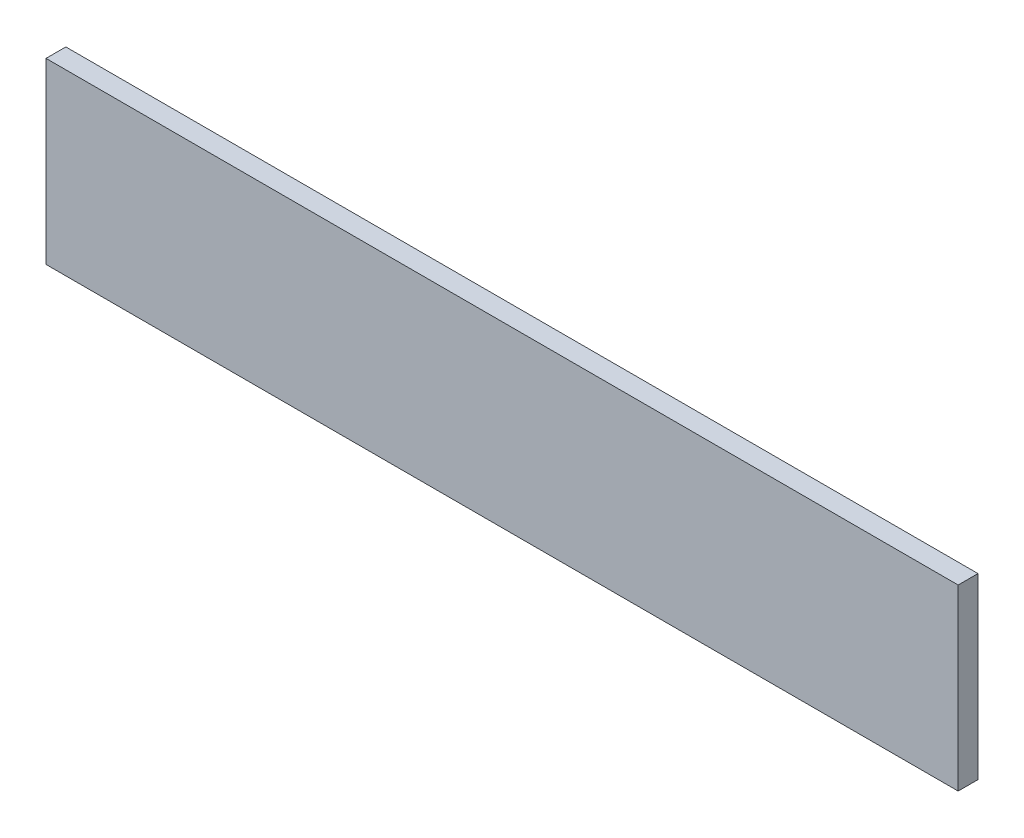
ISO-10303-21;
HEADER;
FILE_DESCRIPTION(('STEP AP214'),'2;1');
FILE_NAME('part.step','',(''),(''),'','','');
FILE_SCHEMA(('AUTOMOTIVE_DESIGN { 1 0 10303 214 1 1 1 1 }'));
ENDSEC;
DATA;
#1=APPLICATION_CONTEXT('core data for automotive mechanical design processes');
#2=APPLICATION_PROTOCOL_DEFINITION('international standard','automotive_design',2000,#1);
#3=PRODUCT_CONTEXT('',#1,'mechanical');
#4=PRODUCT('Part','Part','',(#3));
#5=PRODUCT_RELATED_PRODUCT_CATEGORY('part','',(#4));
#6=PRODUCT_DEFINITION_FORMATION('','',#4);
#7=PRODUCT_DEFINITION_CONTEXT('part definition',#1,'design');
#8=PRODUCT_DEFINITION('design','',#6,#7);
#9=PRODUCT_DEFINITION_SHAPE('','',#8);
#10=(LENGTH_UNIT() NAMED_UNIT(*) SI_UNIT(.MILLI.,.METRE.));
#11=(NAMED_UNIT(*) PLANE_ANGLE_UNIT() SI_UNIT($,.RADIAN.));
#12=(NAMED_UNIT(*) SI_UNIT($,.STERADIAN.) SOLID_ANGLE_UNIT());
#13=UNCERTAINTY_MEASURE_WITH_UNIT(LENGTH_MEASURE(1.E-05),#10,'distance_accuracy_value','');
#14=(GEOMETRIC_REPRESENTATION_CONTEXT(3) GLOBAL_UNCERTAINTY_ASSIGNED_CONTEXT((#13)) GLOBAL_UNIT_ASSIGNED_CONTEXT((#10,
#11,#12)) REPRESENTATION_CONTEXT('',''));
#15=CARTESIAN_POINT('',(0.,0.,0.));
#16=DIRECTION('',(0.,0.,1.));
#17=DIRECTION('',(1.,0.,0.));
#18=AXIS2_PLACEMENT_3D('',#15,#16,#17);
#19=CARTESIAN_POINT('',(0.,0.,6.35));
#20=DIRECTION('',(-1.,0.,0.));
#21=DIRECTION('',(0.,0.,1.));
#22=AXIS2_PLACEMENT_3D('',#19,#20,#21);
#23=PLANE('',#22);
#24=DIRECTION('',(0.,1.,0.));
#25=VECTOR('',#24,1.);
#26=CARTESIAN_POINT('',(0.,0.,0.));
#27=LINE('',#26,#25);
#28=CARTESIAN_POINT('',(0.,0.,0.));
#29=VERTEX_POINT('',#28);
#30=CARTESIAN_POINT('',(0.,57.15,0.));
#31=VERTEX_POINT('',#30);
#32=EDGE_CURVE('E110',#29,#31,#27,.T.);
#33=ORIENTED_EDGE('',*,*,#32,.F.);
#34=DIRECTION('',(0.,0.,-1.));
#35=VECTOR('',#34,1.);
#36=CARTESIAN_POINT('',(0.,0.,6.35));
#37=LINE('',#36,#35);
#38=CARTESIAN_POINT('',(0.,0.,6.35));
#39=VERTEX_POINT('',#38);
#40=EDGE_CURVE('E11',#39,#29,#37,.T.);
#41=ORIENTED_EDGE('',*,*,#40,.F.);
#42=DIRECTION('',(0.,1.,0.));
#43=VECTOR('',#42,1.);
#44=CARTESIAN_POINT('',(0.,0.,6.35));
#45=LINE('',#44,#43);
#46=CARTESIAN_POINT('',(0.,57.15,6.35));
#47=VERTEX_POINT('',#46);
#48=EDGE_CURVE('E103',#39,#47,#45,.T.);
#49=ORIENTED_EDGE('',*,*,#48,.T.);
#50=DIRECTION('',(0.,0.,-1.));
#51=VECTOR('',#50,1.);
#52=CARTESIAN_POINT('',(0.,57.15,6.35));
#53=LINE('',#52,#51);
#54=EDGE_CURVE('E42',#47,#31,#53,.T.);
#55=ORIENTED_EDGE('',*,*,#54,.T.);
#56=EDGE_LOOP('',(#33,#41,#49,#55));
#57=FACE_BOUND('',#56,.T.);
#58=ADVANCED_FACE('F39',(#57),#23,.T.);
#59=CARTESIAN_POINT('',(0.,0.,6.35));
#60=DIRECTION('',(0.,1.,0.));
#61=DIRECTION('',(0.,0.,1.));
#62=AXIS2_PLACEMENT_3D('',#59,#60,#61);
#63=PLANE('',#62);
#64=DIRECTION('',(1.,0.,0.));
#65=VECTOR('',#64,1.);
#66=CARTESIAN_POINT('',(0.,0.,0.));
#67=LINE('',#66,#65);
#68=CARTESIAN_POINT('',(292.1,0.,0.));
#69=VERTEX_POINT('',#68);
#70=EDGE_CURVE('E73',#29,#69,#67,.T.);
#71=ORIENTED_EDGE('',*,*,#70,.T.);
#72=DIRECTION('',(0.,0.,-1.));
#73=VECTOR('',#72,1.);
#74=CARTESIAN_POINT('',(292.1,0.,6.35));
#75=LINE('',#74,#73);
#76=CARTESIAN_POINT('',(292.1,0.,6.35));
#77=VERTEX_POINT('',#76);
#78=EDGE_CURVE('E49',#77,#69,#75,.T.);
#79=ORIENTED_EDGE('',*,*,#78,.F.);
#80=DIRECTION('',(1.,0.,0.));
#81=VECTOR('',#80,1.);
#82=CARTESIAN_POINT('',(0.,0.,6.35));
#83=LINE('',#82,#81);
#84=EDGE_CURVE('E90',#39,#77,#83,.T.);
#85=ORIENTED_EDGE('',*,*,#84,.F.);
#86=ORIENTED_EDGE('',*,*,#40,.T.);
#87=EDGE_LOOP('',(#71,#79,#85,#86));
#88=FACE_BOUND('',#87,.T.);
#89=ADVANCED_FACE('F126',(#88),#63,.F.);
#90=CARTESIAN_POINT('',(292.1,0.,6.35));
#91=DIRECTION('',(-1.,0.,0.));
#92=DIRECTION('',(0.,0.,1.));
#93=AXIS2_PLACEMENT_3D('',#90,#91,#92);
#94=PLANE('',#93);
#95=DIRECTION('',(0.,1.,0.));
#96=VECTOR('',#95,1.);
#97=CARTESIAN_POINT('',(292.1,0.,0.));
#98=LINE('',#97,#96);
#99=CARTESIAN_POINT('',(292.1,57.15,0.));
#100=VERTEX_POINT('',#99);
#101=EDGE_CURVE('E98',#69,#100,#98,.T.);
#102=ORIENTED_EDGE('',*,*,#101,.T.);
#103=DIRECTION('',(0.,0.,-1.));
#104=VECTOR('',#103,1.);
#105=CARTESIAN_POINT('',(292.1,57.15,6.35));
#106=LINE('',#105,#104);
#107=CARTESIAN_POINT('',(292.1,57.15,6.35));
#108=VERTEX_POINT('',#107);
#109=EDGE_CURVE('E95',#108,#100,#106,.T.);
#110=ORIENTED_EDGE('',*,*,#109,.F.);
#111=DIRECTION('',(0.,1.,0.));
#112=VECTOR('',#111,1.);
#113=CARTESIAN_POINT('',(292.1,0.,6.35));
#114=LINE('',#113,#112);
#115=EDGE_CURVE('E85',#77,#108,#114,.T.);
#116=ORIENTED_EDGE('',*,*,#115,.F.);
#117=ORIENTED_EDGE('',*,*,#78,.T.);
#118=EDGE_LOOP('',(#102,#110,#116,#117));
#119=FACE_BOUND('',#118,.T.);
#120=ADVANCED_FACE('F96',(#119),#94,.F.);
#121=CARTESIAN_POINT('',(0.,57.15,6.35));
#122=DIRECTION('',(0.,1.,0.));
#123=DIRECTION('',(0.,0.,1.));
#124=AXIS2_PLACEMENT_3D('',#121,#122,#123);
#125=PLANE('',#124);
#126=DIRECTION('',(1.,0.,0.));
#127=VECTOR('',#126,1.);
#128=CARTESIAN_POINT('',(0.,57.15,0.));
#129=LINE('',#128,#127);
#130=EDGE_CURVE('E114',#31,#100,#129,.T.);
#131=ORIENTED_EDGE('',*,*,#130,.F.);
#132=ORIENTED_EDGE('',*,*,#54,.F.);
#133=DIRECTION('',(1.,0.,0.));
#134=VECTOR('',#133,1.);
#135=CARTESIAN_POINT('',(0.,57.15,6.35));
#136=LINE('',#135,#134);
#137=EDGE_CURVE('E89',#47,#108,#136,.T.);
#138=ORIENTED_EDGE('',*,*,#137,.T.);
#139=ORIENTED_EDGE('',*,*,#109,.T.);
#140=EDGE_LOOP('',(#131,#132,#138,#139));
#141=FACE_BOUND('',#140,.T.);
#142=ADVANCED_FACE('F101',(#141),#125,.T.);
#143=CARTESIAN_POINT('',(0.,0.,6.35));
#144=DIRECTION('',(0.,0.,-1.));
#145=DIRECTION('',(-1.,0.,0.));
#146=AXIS2_PLACEMENT_3D('',#143,#144,#145);
#147=PLANE('',#146);
#148=ORIENTED_EDGE('',*,*,#48,.F.);
#149=ORIENTED_EDGE('',*,*,#84,.T.);
#150=ORIENTED_EDGE('',*,*,#115,.T.);
#151=ORIENTED_EDGE('',*,*,#137,.F.);
#152=EDGE_LOOP('',(#148,#149,#150,#151));
#153=FACE_BOUND('',#152,.T.);
#154=ADVANCED_FACE('F88',(#153),#147,.F.);
#155=CARTESIAN_POINT('',(0.,0.,0.));
#156=DIRECTION('',(0.,0.,-1.));
#157=DIRECTION('',(-1.,0.,0.));
#158=AXIS2_PLACEMENT_3D('',#155,#156,#157);
#159=PLANE('',#158);
#160=ORIENTED_EDGE('',*,*,#32,.T.);
#161=ORIENTED_EDGE('',*,*,#130,.T.);
#162=ORIENTED_EDGE('',*,*,#101,.F.);
#163=ORIENTED_EDGE('',*,*,#70,.F.);
#164=EDGE_LOOP('',(#160,#161,#162,#163));
#165=FACE_BOUND('',#164,.T.);
#166=ADVANCED_FACE('F123',(#165),#159,.T.);
#167=CLOSED_SHELL('',(#58,#89,#120,#142,#154,#166));
#168=MANIFOLD_SOLID_BREP('B2',#167);
#169=ADVANCED_BREP_SHAPE_REPRESENTATION('',(#18,#168),#14);
#170=SHAPE_DEFINITION_REPRESENTATION(#9,#169);
ENDSEC;
END-ISO-10303-21;
